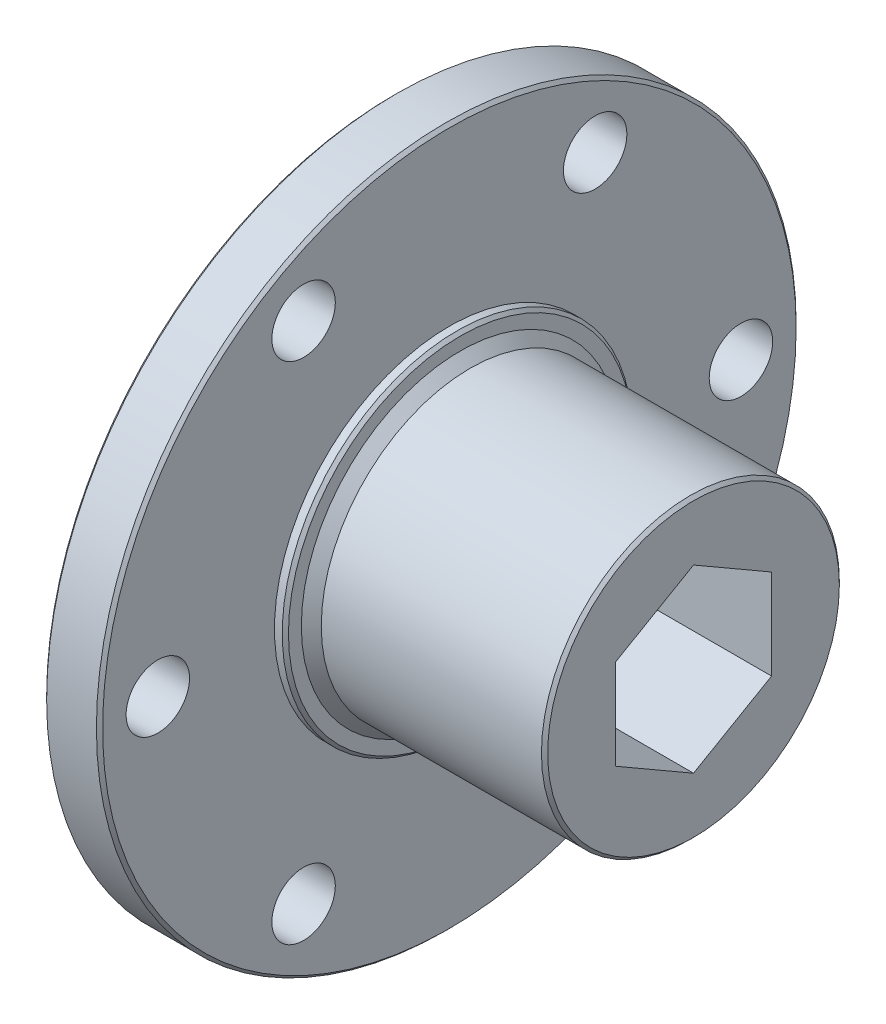
ISO-10303-21;
HEADER;
FILE_DESCRIPTION(('STEP AP214'),'2;1');
FILE_NAME('part.step','',(''),(''),'','','');
FILE_SCHEMA(('AUTOMOTIVE_DESIGN { 1 0 10303 214 1 1 1 1 }'));
ENDSEC;
DATA;
#1=APPLICATION_CONTEXT('core data for automotive mechanical design processes');
#2=APPLICATION_PROTOCOL_DEFINITION('international standard','automotive_design',2000,#1);
#3=PRODUCT_CONTEXT('',#1,'mechanical');
#4=PRODUCT('Part','Part','',(#3));
#5=PRODUCT_RELATED_PRODUCT_CATEGORY('part','',(#4));
#6=PRODUCT_DEFINITION_FORMATION('','',#4);
#7=PRODUCT_DEFINITION_CONTEXT('part definition',#1,'design');
#8=PRODUCT_DEFINITION('design','',#6,#7);
#9=PRODUCT_DEFINITION_SHAPE('','',#8);
#10=(LENGTH_UNIT() NAMED_UNIT(*) SI_UNIT(.MILLI.,.METRE.));
#11=(NAMED_UNIT(*) PLANE_ANGLE_UNIT() SI_UNIT($,.RADIAN.));
#12=(NAMED_UNIT(*) SI_UNIT($,.STERADIAN.) SOLID_ANGLE_UNIT());
#13=UNCERTAINTY_MEASURE_WITH_UNIT(LENGTH_MEASURE(1.E-05),#10,'distance_accuracy_value','');
#14=(GEOMETRIC_REPRESENTATION_CONTEXT(3) GLOBAL_UNCERTAINTY_ASSIGNED_CONTEXT((#13)) GLOBAL_UNIT_ASSIGNED_CONTEXT((#10,
#11,#12)) REPRESENTATION_CONTEXT('',''));
#15=CARTESIAN_POINT('',(0.,0.,0.));
#16=DIRECTION('',(0.,0.,1.));
#17=DIRECTION('',(1.,0.,0.));
#18=AXIS2_PLACEMENT_3D('',#15,#16,#17);
#19=CARTESIAN_POINT('',(-13.9240662460568,0.,0.));
#20=DIRECTION('',(-1.,0.,0.));
#21=DIRECTION('',(0.,0.,1.));
#22=AXIS2_PLACEMENT_3D('',#19,#20,#21);
#23=CYLINDRICAL_SURFACE('',#22,28.575);
#24=CARTESIAN_POINT('',(-18.2420662460566,0.,0.));
#25=DIRECTION('',(-1.,0.,0.));
#26=DIRECTION('',(0.,0.,1.));
#27=AXIS2_PLACEMENT_3D('',#24,#25,#26);
#28=CIRCLE('',#27,28.575);
#29=CARTESIAN_POINT('',(-18.2420662460566,0.,28.575));
#30=VERTEX_POINT('',#29);
#31=EDGE_CURVE('E169',#30,#30,#28,.F.);
#32=ORIENTED_EDGE('',*,*,#31,.T.);
#33=EDGE_LOOP('',(#32));
#34=FACE_BOUND('',#33,.T.);
#35=CARTESIAN_POINT('',(-14.1780662460569,0.,0.));
#36=DIRECTION('',(1.,0.,0.));
#37=DIRECTION('',(0.,0.,-1.));
#38=AXIS2_PLACEMENT_3D('',#35,#36,#37);
#39=CIRCLE('',#38,28.575);
#40=CARTESIAN_POINT('',(-14.1780662460569,0.,-28.575));
#41=VERTEX_POINT('',#40);
#42=EDGE_CURVE('E166',#41,#41,#39,.F.);
#43=ORIENTED_EDGE('',*,*,#42,.T.);
#44=EDGE_LOOP('',(#43));
#45=FACE_BOUND('',#44,.T.);
#46=ADVANCED_FACE('F32',(#34,#45),#23,.T.);
#47=CARTESIAN_POINT('',(-13.9240662460568,28.575,0.));
#48=DIRECTION('',(1.,0.,0.));
#49=DIRECTION('',(0.,0.,-1.));
#50=AXIS2_PLACEMENT_3D('',#47,#48,#49);
#51=PLANE('',#50);
#52=CARTESIAN_POINT('',(-13.9240662460568,0.,0.));
#53=DIRECTION('',(1.,0.,0.));
#54=DIRECTION('',(0.,0.,-1.));
#55=AXIS2_PLACEMENT_3D('',#52,#53,#54);
#56=CIRCLE('',#55,28.3209999999999);
#57=CARTESIAN_POINT('',(-13.9240662460568,0.,-28.3209999999999));
#58=VERTEX_POINT('',#57);
#59=EDGE_CURVE('E11',#58,#58,#56,.T.);
#60=ORIENTED_EDGE('',*,*,#59,.T.);
#61=EDGE_LOOP('',(#60));
#62=FACE_BOUND('',#61,.T.);
#63=CARTESIAN_POINT('',(-13.9240662460568,20.6222299276169,11.90625));
#64=DIRECTION('',(1.,0.,0.));
#65=DIRECTION('',(0.,0.,-1.));
#66=AXIS2_PLACEMENT_3D('',#63,#64,#65);
#67=CIRCLE('',#66,2.5908);
#68=CARTESIAN_POINT('',(-13.9240662460568,20.6222299276169,9.31545000000001));
#69=VERTEX_POINT('',#68);
#70=EDGE_CURVE('E321',#69,#69,#67,.T.);
#71=ORIENTED_EDGE('',*,*,#70,.F.);
#72=EDGE_LOOP('',(#71));
#73=FACE_BOUND('',#72,.T.);
#74=CARTESIAN_POINT('',(-13.9240662460568,0.,-23.8125));
#75=DIRECTION('',(1.,0.,0.));
#76=DIRECTION('',(0.,0.,-1.));
#77=AXIS2_PLACEMENT_3D('',#74,#75,#76);
#78=CIRCLE('',#77,2.5908);
#79=CARTESIAN_POINT('',(-13.9240662460568,0.,-26.4033));
#80=VERTEX_POINT('',#79);
#81=EDGE_CURVE('E326',#80,#80,#78,.T.);
#82=ORIENTED_EDGE('',*,*,#81,.F.);
#83=EDGE_LOOP('',(#82));
#84=FACE_BOUND('',#83,.T.);
#85=CARTESIAN_POINT('',(-13.9240662460568,-20.622229927617,11.9062499999999));
#86=DIRECTION('',(1.,0.,0.));
#87=DIRECTION('',(0.,0.,-1.));
#88=AXIS2_PLACEMENT_3D('',#85,#86,#87);
#89=CIRCLE('',#88,2.5908);
#90=CARTESIAN_POINT('',(-13.9240662460568,-20.622229927617,9.31544999999995));
#91=VERTEX_POINT('',#90);
#92=EDGE_CURVE('E330',#91,#91,#89,.T.);
#93=ORIENTED_EDGE('',*,*,#92,.F.);
#94=EDGE_LOOP('',(#93));
#95=FACE_BOUND('',#94,.T.);
#96=CARTESIAN_POINT('',(-13.9240662460568,-20.6222299276169,-11.90625));
#97=DIRECTION('',(1.,0.,0.));
#98=DIRECTION('',(0.,0.,-1.));
#99=AXIS2_PLACEMENT_3D('',#96,#97,#98);
#100=CIRCLE('',#99,2.5908);
#101=CARTESIAN_POINT('',(-13.9240662460568,-20.6222299276169,-14.49705));
#102=VERTEX_POINT('',#101);
#103=EDGE_CURVE('E334',#102,#102,#100,.T.);
#104=ORIENTED_EDGE('',*,*,#103,.F.);
#105=EDGE_LOOP('',(#104));
#106=FACE_BOUND('',#105,.T.);
#107=CARTESIAN_POINT('',(-13.9240662460568,20.622229927617,-11.90625));
#108=DIRECTION('',(1.,0.,0.));
#109=DIRECTION('',(0.,0.,-1.));
#110=AXIS2_PLACEMENT_3D('',#107,#108,#109);
#111=CIRCLE('',#110,2.5908);
#112=CARTESIAN_POINT('',(-13.9240662460568,20.622229927617,-14.49705));
#113=VERTEX_POINT('',#112);
#114=EDGE_CURVE('E338',#113,#113,#111,.T.);
#115=ORIENTED_EDGE('',*,*,#114,.F.);
#116=EDGE_LOOP('',(#115));
#117=FACE_BOUND('',#116,.T.);
#118=CARTESIAN_POINT('',(-13.9240662460568,0.,23.8125));
#119=DIRECTION('',(1.,0.,0.));
#120=DIRECTION('',(0.,0.,-1.));
#121=AXIS2_PLACEMENT_3D('',#118,#119,#120);
#122=CIRCLE('',#121,2.5908);
#123=CARTESIAN_POINT('',(-13.9240662460568,0.,21.2217));
#124=VERTEX_POINT('',#123);
#125=EDGE_CURVE('E109',#124,#124,#122,.T.);
#126=ORIENTED_EDGE('',*,*,#125,.F.);
#127=EDGE_LOOP('',(#126));
#128=FACE_BOUND('',#127,.T.);
#129=CARTESIAN_POINT('',(-13.9240662460568,0.,0.));
#130=DIRECTION('',(1.,0.,0.));
#131=DIRECTION('',(0.,0.,-1.));
#132=AXIS2_PLACEMENT_3D('',#129,#130,#131);
#133=CIRCLE('',#132,14.2875);
#134=CARTESIAN_POINT('',(-13.9240662460568,0.,-14.2875));
#135=VERTEX_POINT('',#134);
#136=EDGE_CURVE('E148',#135,#135,#133,.T.);
#137=ORIENTED_EDGE('',*,*,#136,.F.);
#138=EDGE_LOOP('',(#137));
#139=FACE_BOUND('',#138,.T.);
#140=ADVANCED_FACE('F204',(#62,#73,#84,#95,#106,#117,#128,#139),#51,.T.);
#141=CARTESIAN_POINT('',(-18.4960662460568,0.,0.));
#142=DIRECTION('',(-1.,0.,0.));
#143=DIRECTION('',(0.,0.,1.));
#144=AXIS2_PLACEMENT_3D('',#141,#142,#143);
#145=PLANE('',#144);
#146=CARTESIAN_POINT('',(-18.4960662460568,0.,0.));
#147=DIRECTION('',(-1.,0.,0.));
#148=DIRECTION('',(0.,0.,1.));
#149=AXIS2_PLACEMENT_3D('',#146,#147,#148);
#150=CIRCLE('',#149,28.3209999999999);
#151=CARTESIAN_POINT('',(-18.4960662460568,0.,28.3209999999999));
#152=VERTEX_POINT('',#151);
#153=EDGE_CURVE('E163',#152,#152,#150,.T.);
#154=ORIENTED_EDGE('',*,*,#153,.T.);
#155=EDGE_LOOP('',(#154));
#156=FACE_BOUND('',#155,.T.);
#157=CARTESIAN_POINT('',(-18.4960662460568,20.6222299276169,11.90625));
#158=DIRECTION('',(-1.,0.,0.));
#159=DIRECTION('',(0.,0.,1.));
#160=AXIS2_PLACEMENT_3D('',#157,#158,#159);
#161=CIRCLE('',#160,2.5908);
#162=CARTESIAN_POINT('',(-18.4960662460568,20.6222299276169,14.49705));
#163=VERTEX_POINT('',#162);
#164=EDGE_CURVE('E238',#163,#163,#161,.T.);
#165=ORIENTED_EDGE('',*,*,#164,.F.);
#166=EDGE_LOOP('',(#165));
#167=FACE_BOUND('',#166,.T.);
#168=CARTESIAN_POINT('',(-18.4960662460568,0.,-23.8125));
#169=DIRECTION('',(-1.,0.,0.));
#170=DIRECTION('',(0.,0.,1.));
#171=AXIS2_PLACEMENT_3D('',#168,#169,#170);
#172=CIRCLE('',#171,2.5908);
#173=CARTESIAN_POINT('',(-18.4960662460568,0.,-21.2217));
#174=VERTEX_POINT('',#173);
#175=EDGE_CURVE('E242',#174,#174,#172,.T.);
#176=ORIENTED_EDGE('',*,*,#175,.F.);
#177=EDGE_LOOP('',(#176));
#178=FACE_BOUND('',#177,.T.);
#179=CARTESIAN_POINT('',(-18.4960662460568,-20.622229927617,11.9062499999999));
#180=DIRECTION('',(-1.,0.,0.));
#181=DIRECTION('',(0.,0.,1.));
#182=AXIS2_PLACEMENT_3D('',#179,#180,#181);
#183=CIRCLE('',#182,2.5908);
#184=CARTESIAN_POINT('',(-18.4960662460568,-20.622229927617,14.4970499999999));
#185=VERTEX_POINT('',#184);
#186=EDGE_CURVE('E246',#185,#185,#183,.T.);
#187=ORIENTED_EDGE('',*,*,#186,.F.);
#188=EDGE_LOOP('',(#187));
#189=FACE_BOUND('',#188,.T.);
#190=CARTESIAN_POINT('',(-18.4960662460568,-20.6222299276169,-11.90625));
#191=DIRECTION('',(-1.,0.,0.));
#192=DIRECTION('',(0.,0.,1.));
#193=AXIS2_PLACEMENT_3D('',#190,#191,#192);
#194=CIRCLE('',#193,2.5908);
#195=CARTESIAN_POINT('',(-18.4960662460568,-20.6222299276169,-9.31545000000004));
#196=VERTEX_POINT('',#195);
#197=EDGE_CURVE('E250',#196,#196,#194,.T.);
#198=ORIENTED_EDGE('',*,*,#197,.F.);
#199=EDGE_LOOP('',(#198));
#200=FACE_BOUND('',#199,.T.);
#201=CARTESIAN_POINT('',(-18.4960662460568,20.622229927617,-11.90625));
#202=DIRECTION('',(-1.,0.,0.));
#203=DIRECTION('',(0.,0.,1.));
#204=AXIS2_PLACEMENT_3D('',#201,#202,#203);
#205=CIRCLE('',#204,2.5908);
#206=CARTESIAN_POINT('',(-18.4960662460568,20.622229927617,-9.31544999999997));
#207=VERTEX_POINT('',#206);
#208=EDGE_CURVE('E254',#207,#207,#205,.T.);
#209=ORIENTED_EDGE('',*,*,#208,.F.);
#210=EDGE_LOOP('',(#209));
#211=FACE_BOUND('',#210,.T.);
#212=CARTESIAN_POINT('',(-18.4960662460568,0.,23.8125));
#213=DIRECTION('',(-1.,0.,0.));
#214=DIRECTION('',(0.,0.,1.));
#215=AXIS2_PLACEMENT_3D('',#212,#213,#214);
#216=CIRCLE('',#215,2.5908);
#217=CARTESIAN_POINT('',(-18.4960662460568,0.,26.4033));
#218=VERTEX_POINT('',#217);
#219=EDGE_CURVE('E258',#218,#218,#216,.T.);
#220=ORIENTED_EDGE('',*,*,#219,.F.);
#221=EDGE_LOOP('',(#220));
#222=FACE_BOUND('',#221,.T.);
#223=CARTESIAN_POINT('',(-18.4960662460568,0.,0.));
#224=DIRECTION('',(-1.,0.,0.));
#225=DIRECTION('',(0.,0.,1.));
#226=AXIS2_PLACEMENT_3D('',#223,#224,#225);
#227=CIRCLE('',#226,14.2875);
#228=CARTESIAN_POINT('',(-18.4960662460568,0.,14.2875));
#229=VERTEX_POINT('',#228);
#230=EDGE_CURVE('E132',#229,#229,#227,.T.);
#231=ORIENTED_EDGE('',*,*,#230,.F.);
#232=EDGE_LOOP('',(#231));
#233=FACE_BOUND('',#232,.T.);
#234=ADVANCED_FACE('F210',(#156,#167,#178,#189,#200,#211,#222,#233),#145,.T.);
#235=CARTESIAN_POINT('',(-13.0350662460568,0.,0.));
#236=DIRECTION('',(-1.,0.,0.));
#237=DIRECTION('',(0.,0.,1.));
#238=AXIS2_PLACEMENT_3D('',#235,#236,#237);
#239=CYLINDRICAL_SURFACE('',#238,14.2875);
#240=CARTESIAN_POINT('',(-13.2890662460569,0.,0.));
#241=DIRECTION('',(1.,0.,0.));
#242=DIRECTION('',(0.,0.,-1.));
#243=AXIS2_PLACEMENT_3D('',#240,#241,#242);
#244=CIRCLE('',#243,14.2875);
#245=CARTESIAN_POINT('',(-13.2890662460569,0.,-14.2875));
#246=VERTEX_POINT('',#245);
#247=EDGE_CURVE('E40',#246,#246,#244,.F.);
#248=ORIENTED_EDGE('',*,*,#247,.T.);
#249=EDGE_LOOP('',(#248));
#250=FACE_BOUND('',#249,.T.);
#251=ORIENTED_EDGE('',*,*,#136,.T.);
#252=EDGE_LOOP('',(#251));
#253=FACE_BOUND('',#252,.T.);
#254=ADVANCED_FACE('F177',(#250,#253),#239,.T.);
#255=CARTESIAN_POINT('',(-13.0350662460568,0.,0.));
#256=DIRECTION('',(1.,0.,0.));
#257=DIRECTION('',(0.,0.,-1.));
#258=AXIS2_PLACEMENT_3D('',#255,#256,#257);
#259=PLANE('',#258);
#260=CARTESIAN_POINT('',(-13.0350662460568,0.,0.));
#261=DIRECTION('',(1.,0.,0.));
#262=DIRECTION('',(0.,0.,-1.));
#263=AXIS2_PLACEMENT_3D('',#260,#261,#262);
#264=CIRCLE('',#263,14.0334999999999);
#265=CARTESIAN_POINT('',(-13.0350662460568,0.,-14.0334999999999));
#266=VERTEX_POINT('',#265);
#267=EDGE_CURVE('E172',#266,#266,#264,.T.);
#268=ORIENTED_EDGE('',*,*,#267,.T.);
#269=EDGE_LOOP('',(#268));
#270=FACE_BOUND('',#269,.T.);
#271=CARTESIAN_POINT('',(-13.0350662460568,0.,0.));
#272=DIRECTION('',(1.,0.,0.));
#273=DIRECTION('',(0.,0.,-1.));
#274=AXIS2_PLACEMENT_3D('',#271,#272,#273);
#275=CIRCLE('',#274,12.9794);
#276=CARTESIAN_POINT('',(-13.0350662460568,0.,-12.9794));
#277=VERTEX_POINT('',#276);
#278=EDGE_CURVE('E142',#277,#277,#275,.T.);
#279=ORIENTED_EDGE('',*,*,#278,.F.);
#280=EDGE_LOOP('',(#279));
#281=FACE_BOUND('',#280,.T.);
#282=ADVANCED_FACE('F186',(#270,#281),#259,.T.);
#283=CARTESIAN_POINT('',(-13.0350662460568,0.,0.));
#284=DIRECTION('',(-1.,0.,0.));
#285=DIRECTION('',(0.,0.,-1.));
#286=AXIS2_PLACEMENT_3D('',#283,#284,#285);
#287=CONICAL_SURFACE('',#286,12.9794,0.785398163397434);
#288=CARTESIAN_POINT('',(-12.2222662460567,0.,0.));
#289=DIRECTION('',(1.,0.,0.));
#290=DIRECTION('',(0.,0.,-1.));
#291=AXIS2_PLACEMENT_3D('',#288,#289,#290);
#292=CIRCLE('',#291,12.1666);
#293=CARTESIAN_POINT('',(-12.2222662460567,0.,-12.1666));
#294=VERTEX_POINT('',#293);
#295=EDGE_CURVE('E145',#294,#294,#292,.T.);
#296=ORIENTED_EDGE('',*,*,#295,.F.);
#297=EDGE_LOOP('',(#296));
#298=FACE_BOUND('',#297,.T.);
#299=ORIENTED_EDGE('',*,*,#278,.T.);
#300=EDGE_LOOP('',(#299));
#301=FACE_BOUND('',#300,.T.);
#302=ADVANCED_FACE('F189',(#298,#301),#287,.T.);
#303=CARTESIAN_POINT('',(6.01493375394323,0.,0.));
#304=DIRECTION('',(-1.,0.,0.));
#305=DIRECTION('',(0.,0.,1.));
#306=AXIS2_PLACEMENT_3D('',#303,#304,#305);
#307=CYLINDRICAL_SURFACE('',#306,12.1666);
#308=CARTESIAN_POINT('',(5.76093375394317,0.,0.));
#309=DIRECTION('',(1.,0.,0.));
#310=DIRECTION('',(0.,0.,-1.));
#311=AXIS2_PLACEMENT_3D('',#308,#309,#310);
#312=CIRCLE('',#311,12.1666);
#313=CARTESIAN_POINT('',(5.76093375394317,0.,-12.1666));
#314=VERTEX_POINT('',#313);
#315=EDGE_CURVE('E160',#314,#314,#312,.F.);
#316=ORIENTED_EDGE('',*,*,#315,.T.);
#317=EDGE_LOOP('',(#316));
#318=FACE_BOUND('',#317,.T.);
#319=ORIENTED_EDGE('',*,*,#295,.T.);
#320=EDGE_LOOP('',(#319));
#321=FACE_BOUND('',#320,.T.);
#322=ADVANCED_FACE('F194',(#318,#321),#307,.T.);
#323=CARTESIAN_POINT('',(6.01493375394323,0.,0.));
#324=DIRECTION('',(1.,0.,0.));
#325=DIRECTION('',(0.,0.,-1.));
#326=AXIS2_PLACEMENT_3D('',#323,#324,#325);
#327=PLANE('',#326);
#328=CARTESIAN_POINT('',(6.01493375394323,0.,0.));
#329=DIRECTION('',(1.,0.,0.));
#330=DIRECTION('',(0.,0.,-1.));
#331=AXIS2_PLACEMENT_3D('',#328,#329,#330);
#332=CIRCLE('',#331,11.9125999999999);
#333=CARTESIAN_POINT('',(6.01493375394323,0.,-11.9125999999999));
#334=VERTEX_POINT('',#333);
#335=EDGE_CURVE('E157',#334,#334,#332,.T.);
#336=ORIENTED_EDGE('',*,*,#335,.T.);
#337=EDGE_LOOP('',(#336));
#338=FACE_BOUND('',#337,.T.);
#339=DIRECTION('',(0.,0.500000000000001,-0.866025403784438));
#340=VECTOR('',#339,1.);
#341=CARTESIAN_POINT('',(6.01493375394323,3.68081890619155,6.3754));
#342=LINE('',#341,#340);
#343=CARTESIAN_POINT('',(6.01493375394323,3.68081890619155,6.3754));
#344=VERTEX_POINT('',#343);
#345=CARTESIAN_POINT('',(6.01493375394323,7.3616578123831,0.));
#346=VERTEX_POINT('',#345);
#347=EDGE_CURVE('E87',#344,#346,#342,.T.);
#348=ORIENTED_EDGE('',*,*,#347,.T.);
#349=DIRECTION('',(0.,-0.500000000000001,-0.866025403784438));
#350=VECTOR('',#349,1.);
#351=CARTESIAN_POINT('',(6.01493375394323,7.3616578123831,0.));
#352=LINE('',#351,#350);
#353=CARTESIAN_POINT('',(6.01493375394323,3.68081890619154,-6.37539999999999));
#354=VERTEX_POINT('',#353);
#355=EDGE_CURVE('E96',#346,#354,#352,.T.);
#356=ORIENTED_EDGE('',*,*,#355,.T.);
#357=DIRECTION('',(0.,-1.,0.));
#358=VECTOR('',#357,1.);
#359=CARTESIAN_POINT('',(6.01493375394323,3.68081890619155,-6.37539999999999));
#360=LINE('',#359,#358);
#361=CARTESIAN_POINT('',(6.01493375394323,-3.68085890619153,-6.37539999999999));
#362=VERTEX_POINT('',#361);
#363=EDGE_CURVE('E47',#354,#362,#360,.T.);
#364=ORIENTED_EDGE('',*,*,#363,.T.);
#365=DIRECTION('',(0.,-0.500000000000001,0.866025403784438));
#366=VECTOR('',#365,1.);
#367=CARTESIAN_POINT('',(6.01493375394323,-3.68085890619153,-6.37539999999999));
#368=LINE('',#367,#366);
#369=CARTESIAN_POINT('',(6.01493375394323,-7.36169781238308,0.));
#370=VERTEX_POINT('',#369);
#371=EDGE_CURVE('E113',#362,#370,#368,.T.);
#372=ORIENTED_EDGE('',*,*,#371,.T.);
#373=DIRECTION('',(0.,0.500000000000001,0.866025403784438));
#374=VECTOR('',#373,1.);
#375=CARTESIAN_POINT('',(6.01493375394323,-7.36169781238308,0.));
#376=LINE('',#375,#374);
#377=CARTESIAN_POINT('',(6.01493375394323,-3.68085890619153,6.3754));
#378=VERTEX_POINT('',#377);
#379=EDGE_CURVE('E116',#370,#378,#376,.T.);
#380=ORIENTED_EDGE('',*,*,#379,.T.);
#381=DIRECTION('',(0.,1.,0.));
#382=VECTOR('',#381,1.);
#383=CARTESIAN_POINT('',(6.01493375394323,-3.68085890619153,6.3754));
#384=LINE('',#383,#382);
#385=EDGE_CURVE('E93',#378,#344,#384,.T.);
#386=ORIENTED_EDGE('',*,*,#385,.T.);
#387=EDGE_LOOP('',(#348,#356,#364,#372,#380,#386));
#388=FACE_BOUND('',#387,.T.);
#389=ADVANCED_FACE('F100',(#338,#388),#327,.T.);
#390=CARTESIAN_POINT('',(-19.3850662460568,0.,0.));
#391=DIRECTION('',(1.,0.,0.));
#392=DIRECTION('',(0.,0.,-1.));
#393=AXIS2_PLACEMENT_3D('',#390,#391,#392);
#394=CYLINDRICAL_SURFACE('',#393,14.2875);
#395=CARTESIAN_POINT('',(-19.1310662460567,0.,0.));
#396=DIRECTION('',(-1.,0.,0.));
#397=DIRECTION('',(0.,0.,1.));
#398=AXIS2_PLACEMENT_3D('',#395,#396,#397);
#399=CIRCLE('',#398,14.2875);
#400=CARTESIAN_POINT('',(-19.1310662460567,0.,14.2875));
#401=VERTEX_POINT('',#400);
#402=EDGE_CURVE('E154',#401,#401,#399,.F.);
#403=ORIENTED_EDGE('',*,*,#402,.T.);
#404=EDGE_LOOP('',(#403));
#405=FACE_BOUND('',#404,.T.);
#406=ORIENTED_EDGE('',*,*,#230,.T.);
#407=EDGE_LOOP('',(#406));
#408=FACE_BOUND('',#407,.T.);
#409=ADVANCED_FACE('F261',(#405,#408),#394,.T.);
#410=CARTESIAN_POINT('',(-19.3850662460568,0.,0.));
#411=DIRECTION('',(-1.,0.,0.));
#412=DIRECTION('',(0.,0.,1.));
#413=AXIS2_PLACEMENT_3D('',#410,#411,#412);
#414=PLANE('',#413);
#415=CARTESIAN_POINT('',(-19.3850662460568,0.,0.));
#416=DIRECTION('',(-1.,0.,0.));
#417=DIRECTION('',(0.,0.,1.));
#418=AXIS2_PLACEMENT_3D('',#415,#416,#417);
#419=CIRCLE('',#418,14.0334999999999);
#420=CARTESIAN_POINT('',(-19.3850662460568,0.,14.0334999999999));
#421=VERTEX_POINT('',#420);
#422=EDGE_CURVE('E151',#421,#421,#419,.T.);
#423=ORIENTED_EDGE('',*,*,#422,.T.);
#424=EDGE_LOOP('',(#423));
#425=FACE_BOUND('',#424,.T.);
#426=DIRECTION('',(0.,0.500000000000001,-0.866025403784438));
#427=VECTOR('',#426,1.);
#428=CARTESIAN_POINT('',(-19.3850662460568,3.68081890619155,6.3754));
#429=LINE('',#428,#427);
#430=CARTESIAN_POINT('',(-19.3850662460568,3.68081890619155,6.3754));
#431=VERTEX_POINT('',#430);
#432=CARTESIAN_POINT('',(-19.3850662460568,7.36165781238309,0.));
#433=VERTEX_POINT('',#432);
#434=EDGE_CURVE('E55',#431,#433,#429,.T.);
#435=ORIENTED_EDGE('',*,*,#434,.F.);
#436=DIRECTION('',(0.,1.,0.));
#437=VECTOR('',#436,1.);
#438=CARTESIAN_POINT('',(-19.3850662460568,-3.68085890619153,6.3754));
#439=LINE('',#438,#437);
#440=CARTESIAN_POINT('',(-19.3850662460568,-3.68085890619153,6.3754));
#441=VERTEX_POINT('',#440);
#442=EDGE_CURVE('E103',#441,#431,#439,.T.);
#443=ORIENTED_EDGE('',*,*,#442,.F.);
#444=DIRECTION('',(0.,0.500000000000001,0.866025403784438));
#445=VECTOR('',#444,1.);
#446=CARTESIAN_POINT('',(-19.3850662460568,-7.36169781238308,0.));
#447=LINE('',#446,#445);
#448=CARTESIAN_POINT('',(-19.3850662460568,-7.36169781238308,0.));
#449=VERTEX_POINT('',#448);
#450=EDGE_CURVE('E106',#449,#441,#447,.T.);
#451=ORIENTED_EDGE('',*,*,#450,.F.);
#452=DIRECTION('',(0.,-0.500000000000001,0.866025403784438));
#453=VECTOR('',#452,1.);
#454=CARTESIAN_POINT('',(-19.3850662460568,-3.68085890619153,-6.37539999999999));
#455=LINE('',#454,#453);
#456=CARTESIAN_POINT('',(-19.3850662460568,-3.68085890619153,-6.37539999999999));
#457=VERTEX_POINT('',#456);
#458=EDGE_CURVE('E125',#457,#449,#455,.T.);
#459=ORIENTED_EDGE('',*,*,#458,.F.);
#460=DIRECTION('',(0.,-1.,0.));
#461=VECTOR('',#460,1.);
#462=CARTESIAN_POINT('',(-19.3850662460568,3.68081890619155,-6.37539999999999));
#463=LINE('',#462,#461);
#464=CARTESIAN_POINT('',(-19.3850662460568,3.68081890619155,-6.37539999999999));
#465=VERTEX_POINT('',#464);
#466=EDGE_CURVE('E122',#465,#457,#463,.T.);
#467=ORIENTED_EDGE('',*,*,#466,.F.);
#468=DIRECTION('',(0.,-0.500000000000001,-0.866025403784438));
#469=VECTOR('',#468,1.);
#470=CARTESIAN_POINT('',(-19.3850662460568,7.3616578123831,0.));
#471=LINE('',#470,#469);
#472=EDGE_CURVE('E120',#433,#465,#471,.T.);
#473=ORIENTED_EDGE('',*,*,#472,.F.);
#474=EDGE_LOOP('',(#435,#443,#451,#459,#467,#473));
#475=FACE_BOUND('',#474,.T.);
#476=ADVANCED_FACE('F263',(#425,#475),#414,.T.);
#477=CARTESIAN_POINT('',(6.01493375394323,3.68081890619155,6.3754));
#478=DIRECTION('',(0.,0.866025403784438,0.500000000000001));
#479=DIRECTION('',(0.,-0.500000000000001,0.866025403784438));
#480=AXIS2_PLACEMENT_3D('',#477,#478,#479);
#481=PLANE('',#480);
#482=ORIENTED_EDGE('',*,*,#434,.T.);
#483=DIRECTION('',(-1.,0.,0.));
#484=VECTOR('',#483,1.);
#485=CARTESIAN_POINT('',(6.01493375394323,7.3616578123831,0.));
#486=LINE('',#485,#484);
#487=EDGE_CURVE('E83',#346,#433,#486,.T.);
#488=ORIENTED_EDGE('',*,*,#487,.F.);
#489=ORIENTED_EDGE('',*,*,#347,.F.);
#490=DIRECTION('',(-1.,0.,0.));
#491=VECTOR('',#490,1.);
#492=CARTESIAN_POINT('',(6.01493375394323,3.68081890619155,6.3754));
#493=LINE('',#492,#491);
#494=EDGE_CURVE('E130',#344,#431,#493,.T.);
#495=ORIENTED_EDGE('',*,*,#494,.T.);
#496=EDGE_LOOP('',(#482,#488,#489,#495));
#497=FACE_BOUND('',#496,.T.);
#498=ADVANCED_FACE('F85',(#497),#481,.F.);
#499=CARTESIAN_POINT('',(6.01493375394323,-3.68085890619153,6.3754));
#500=DIRECTION('',(0.,0.,1.));
#501=DIRECTION('',(0.,-1.,0.));
#502=AXIS2_PLACEMENT_3D('',#499,#500,#501);
#503=PLANE('',#502);
#504=ORIENTED_EDGE('',*,*,#442,.T.);
#505=ORIENTED_EDGE('',*,*,#494,.F.);
#506=ORIENTED_EDGE('',*,*,#385,.F.);
#507=DIRECTION('',(-1.,0.,0.));
#508=VECTOR('',#507,1.);
#509=CARTESIAN_POINT('',(6.01493375394323,-3.68085890619153,6.3754));
#510=LINE('',#509,#508);
#511=EDGE_CURVE('E133',#378,#441,#510,.T.);
#512=ORIENTED_EDGE('',*,*,#511,.T.);
#513=EDGE_LOOP('',(#504,#505,#506,#512));
#514=FACE_BOUND('',#513,.T.);
#515=ADVANCED_FACE('F277',(#514),#503,.F.);
#516=CARTESIAN_POINT('',(6.01493375394323,-7.36169781238308,0.));
#517=DIRECTION('',(0.,-0.866025403784438,0.500000000000001));
#518=DIRECTION('',(0.,-0.500000000000001,-0.866025403784438));
#519=AXIS2_PLACEMENT_3D('',#516,#517,#518);
#520=PLANE('',#519);
#521=ORIENTED_EDGE('',*,*,#450,.T.);
#522=ORIENTED_EDGE('',*,*,#511,.F.);
#523=ORIENTED_EDGE('',*,*,#379,.F.);
#524=DIRECTION('',(-1.,0.,0.));
#525=VECTOR('',#524,1.);
#526=CARTESIAN_POINT('',(6.01493375394323,-7.36169781238308,0.));
#527=LINE('',#526,#525);
#528=EDGE_CURVE('E135',#370,#449,#527,.T.);
#529=ORIENTED_EDGE('',*,*,#528,.T.);
#530=EDGE_LOOP('',(#521,#522,#523,#529));
#531=FACE_BOUND('',#530,.T.);
#532=ADVANCED_FACE('F287',(#531),#520,.F.);
#533=CARTESIAN_POINT('',(6.01493375394323,-3.68085890619153,-6.37539999999999));
#534=DIRECTION('',(0.,-0.866025403784438,-0.500000000000001));
#535=DIRECTION('',(0.,0.500000000000001,-0.866025403784438));
#536=AXIS2_PLACEMENT_3D('',#533,#534,#535);
#537=PLANE('',#536);
#538=ORIENTED_EDGE('',*,*,#458,.T.);
#539=ORIENTED_EDGE('',*,*,#528,.F.);
#540=ORIENTED_EDGE('',*,*,#371,.F.);
#541=DIRECTION('',(-1.,0.,0.));
#542=VECTOR('',#541,1.);
#543=CARTESIAN_POINT('',(6.01493375394323,-3.68085890619153,-6.37539999999999));
#544=LINE('',#543,#542);
#545=EDGE_CURVE('E137',#362,#457,#544,.T.);
#546=ORIENTED_EDGE('',*,*,#545,.T.);
#547=EDGE_LOOP('',(#538,#539,#540,#546));
#548=FACE_BOUND('',#547,.T.);
#549=ADVANCED_FACE('F284',(#548),#537,.F.);
#550=CARTESIAN_POINT('',(6.01493375394323,3.68081890619155,-6.37539999999999));
#551=DIRECTION('',(0.,0.,-1.));
#552=DIRECTION('',(0.,1.,0.));
#553=AXIS2_PLACEMENT_3D('',#550,#551,#552);
#554=PLANE('',#553);
#555=ORIENTED_EDGE('',*,*,#466,.T.);
#556=ORIENTED_EDGE('',*,*,#545,.F.);
#557=ORIENTED_EDGE('',*,*,#363,.F.);
#558=DIRECTION('',(-1.,0.,0.));
#559=VECTOR('',#558,1.);
#560=CARTESIAN_POINT('',(6.01493375394323,3.68081890619155,-6.37539999999999));
#561=LINE('',#560,#559);
#562=EDGE_CURVE('E92',#354,#465,#561,.T.);
#563=ORIENTED_EDGE('',*,*,#562,.T.);
#564=EDGE_LOOP('',(#555,#556,#557,#563));
#565=FACE_BOUND('',#564,.T.);
#566=ADVANCED_FACE('F281',(#565),#554,.F.);
#567=CARTESIAN_POINT('',(6.01493375394323,7.3616578123831,0.));
#568=DIRECTION('',(0.,0.866025403784438,-0.500000000000001));
#569=DIRECTION('',(0.,0.500000000000001,0.866025403784438));
#570=AXIS2_PLACEMENT_3D('',#567,#568,#569);
#571=PLANE('',#570);
#572=ORIENTED_EDGE('',*,*,#472,.T.);
#573=ORIENTED_EDGE('',*,*,#562,.F.);
#574=ORIENTED_EDGE('',*,*,#355,.F.);
#575=ORIENTED_EDGE('',*,*,#487,.T.);
#576=EDGE_LOOP('',(#572,#573,#574,#575));
#577=FACE_BOUND('',#576,.T.);
#578=ADVANCED_FACE('F97',(#577),#571,.F.);
#579=CARTESIAN_POINT('',(-18.4960662460568,0.,23.8125));
#580=DIRECTION('',(-1.,0.,0.));
#581=DIRECTION('',(0.,0.,1.));
#582=AXIS2_PLACEMENT_3D('',#579,#580,#581);
#583=CYLINDRICAL_SURFACE('',#582,2.5908);
#584=ORIENTED_EDGE('',*,*,#125,.T.);
#585=EDGE_LOOP('',(#584));
#586=FACE_BOUND('',#585,.T.);
#587=ORIENTED_EDGE('',*,*,#219,.T.);
#588=EDGE_LOOP('',(#587));
#589=FACE_BOUND('',#588,.T.);
#590=ADVANCED_FACE('F280',(#586,#589),#583,.F.);
#591=CARTESIAN_POINT('',(-18.4960662460568,20.622229927617,-11.90625));
#592=DIRECTION('',(-1.,0.,0.));
#593=DIRECTION('',(0.,0.,1.));
#594=AXIS2_PLACEMENT_3D('',#591,#592,#593);
#595=CYLINDRICAL_SURFACE('',#594,2.5908);
#596=ORIENTED_EDGE('',*,*,#114,.T.);
#597=EDGE_LOOP('',(#596));
#598=FACE_BOUND('',#597,.T.);
#599=ORIENTED_EDGE('',*,*,#208,.T.);
#600=EDGE_LOOP('',(#599));
#601=FACE_BOUND('',#600,.T.);
#602=ADVANCED_FACE('F297',(#598,#601),#595,.F.);
#603=CARTESIAN_POINT('',(-18.4960662460568,-20.6222299276169,-11.90625));
#604=DIRECTION('',(-1.,0.,0.));
#605=DIRECTION('',(0.,0.,1.));
#606=AXIS2_PLACEMENT_3D('',#603,#604,#605);
#607=CYLINDRICAL_SURFACE('',#606,2.5908);
#608=ORIENTED_EDGE('',*,*,#103,.T.);
#609=EDGE_LOOP('',(#608));
#610=FACE_BOUND('',#609,.T.);
#611=ORIENTED_EDGE('',*,*,#197,.T.);
#612=EDGE_LOOP('',(#611));
#613=FACE_BOUND('',#612,.T.);
#614=ADVANCED_FACE('F301',(#610,#613),#607,.F.);
#615=CARTESIAN_POINT('',(-18.4960662460568,-20.622229927617,11.9062499999999));
#616=DIRECTION('',(-1.,0.,0.));
#617=DIRECTION('',(0.,0.,1.));
#618=AXIS2_PLACEMENT_3D('',#615,#616,#617);
#619=CYLINDRICAL_SURFACE('',#618,2.5908);
#620=ORIENTED_EDGE('',*,*,#92,.T.);
#621=EDGE_LOOP('',(#620));
#622=FACE_BOUND('',#621,.T.);
#623=ORIENTED_EDGE('',*,*,#186,.T.);
#624=EDGE_LOOP('',(#623));
#625=FACE_BOUND('',#624,.T.);
#626=ADVANCED_FACE('F305',(#622,#625),#619,.F.);
#627=CARTESIAN_POINT('',(-18.4960662460568,0.,-23.8125));
#628=DIRECTION('',(-1.,0.,0.));
#629=DIRECTION('',(0.,0.,1.));
#630=AXIS2_PLACEMENT_3D('',#627,#628,#629);
#631=CYLINDRICAL_SURFACE('',#630,2.5908);
#632=ORIENTED_EDGE('',*,*,#81,.T.);
#633=EDGE_LOOP('',(#632));
#634=FACE_BOUND('',#633,.T.);
#635=ORIENTED_EDGE('',*,*,#175,.T.);
#636=EDGE_LOOP('',(#635));
#637=FACE_BOUND('',#636,.T.);
#638=ADVANCED_FACE('F309',(#634,#637),#631,.F.);
#639=CARTESIAN_POINT('',(-18.4960662460568,20.6222299276169,11.90625));
#640=DIRECTION('',(-1.,0.,0.));
#641=DIRECTION('',(0.,0.,1.));
#642=AXIS2_PLACEMENT_3D('',#639,#640,#641);
#643=CYLINDRICAL_SURFACE('',#642,2.5908);
#644=ORIENTED_EDGE('',*,*,#70,.T.);
#645=EDGE_LOOP('',(#644));
#646=FACE_BOUND('',#645,.T.);
#647=ORIENTED_EDGE('',*,*,#164,.T.);
#648=EDGE_LOOP('',(#647));
#649=FACE_BOUND('',#648,.T.);
#650=ADVANCED_FACE('F220',(#646,#649),#643,.F.);
#651=CARTESIAN_POINT('',(-19.3850662460568,0.,0.));
#652=DIRECTION('',(1.,0.,0.));
#653=DIRECTION('',(0.,0.,-1.));
#654=AXIS2_PLACEMENT_3D('',#651,#652,#653);
#655=CONICAL_SURFACE('',#654,14.0334999999999,0.785398163397448);
#656=ORIENTED_EDGE('',*,*,#402,.F.);
#657=EDGE_LOOP('',(#656));
#658=FACE_BOUND('',#657,.T.);
#659=ORIENTED_EDGE('',*,*,#422,.F.);
#660=EDGE_LOOP('',(#659));
#661=FACE_BOUND('',#660,.T.);
#662=ADVANCED_FACE('F216',(#658,#661),#655,.T.);
#663=CARTESIAN_POINT('',(6.01493375394323,0.,0.));
#664=DIRECTION('',(-1.,0.,0.));
#665=DIRECTION('',(0.,0.,1.));
#666=AXIS2_PLACEMENT_3D('',#663,#664,#665);
#667=CONICAL_SURFACE('',#666,11.9125999999999,0.785398163397452);
#668=ORIENTED_EDGE('',*,*,#315,.F.);
#669=EDGE_LOOP('',(#668));
#670=FACE_BOUND('',#669,.T.);
#671=ORIENTED_EDGE('',*,*,#335,.F.);
#672=EDGE_LOOP('',(#671));
#673=FACE_BOUND('',#672,.T.);
#674=ADVANCED_FACE('F219',(#670,#673),#667,.T.);
#675=CARTESIAN_POINT('',(-18.4960662460568,0.,0.));
#676=DIRECTION('',(1.,0.,0.));
#677=DIRECTION('',(0.,0.,-1.));
#678=AXIS2_PLACEMENT_3D('',#675,#676,#677);
#679=CONICAL_SURFACE('',#678,28.3209999999999,0.785398163397455);
#680=ORIENTED_EDGE('',*,*,#31,.F.);
#681=EDGE_LOOP('',(#680));
#682=FACE_BOUND('',#681,.T.);
#683=ORIENTED_EDGE('',*,*,#153,.F.);
#684=EDGE_LOOP('',(#683));
#685=FACE_BOUND('',#684,.T.);
#686=ADVANCED_FACE('F183',(#682,#685),#679,.T.);
#687=CARTESIAN_POINT('',(-13.0350662460568,0.,0.));
#688=DIRECTION('',(-1.,0.,0.));
#689=DIRECTION('',(0.,0.,1.));
#690=AXIS2_PLACEMENT_3D('',#687,#688,#689);
#691=CONICAL_SURFACE('',#690,14.0334999999999,0.785398163397445);
#692=ORIENTED_EDGE('',*,*,#247,.F.);
#693=EDGE_LOOP('',(#692));
#694=FACE_BOUND('',#693,.T.);
#695=ORIENTED_EDGE('',*,*,#267,.F.);
#696=EDGE_LOOP('',(#695));
#697=FACE_BOUND('',#696,.T.);
#698=ADVANCED_FACE('F180',(#694,#697),#691,.T.);
#699=CARTESIAN_POINT('',(-14.1780662460569,0.,0.));
#700=DIRECTION('',(-1.,0.,0.));
#701=DIRECTION('',(0.,0.,1.));
#702=AXIS2_PLACEMENT_3D('',#699,#700,#701);
#703=CONICAL_SURFACE('',#702,28.575,0.785398163397455);
#704=ORIENTED_EDGE('',*,*,#59,.F.);
#705=EDGE_LOOP('',(#704));
#706=FACE_BOUND('',#705,.T.);
#707=ORIENTED_EDGE('',*,*,#42,.F.);
#708=EDGE_LOOP('',(#707));
#709=FACE_BOUND('',#708,.T.);
#710=ADVANCED_FACE('F34',(#706,#709),#703,.T.);
#711=CLOSED_SHELL('',(#46,#140,#234,#254,#282,#302,#322,#389,#409,#476,#498,#515,#532,#549,#566,
#578,#590,#602,#614,#626,#638,#650,#662,#674,#686,#698,#710));
#712=MANIFOLD_SOLID_BREP('B2',#711);
#713=ADVANCED_BREP_SHAPE_REPRESENTATION('',(#18,#712),#14);
#714=SHAPE_DEFINITION_REPRESENTATION(#9,#713);
ENDSEC;
END-ISO-10303-21;
